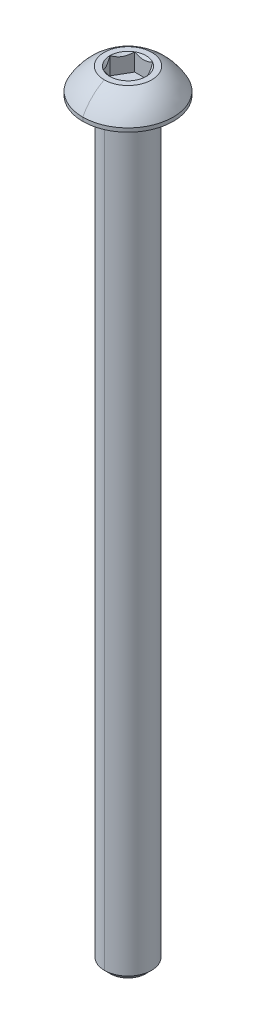
ISO-10303-21;
HEADER;
FILE_DESCRIPTION(('STEP AP214'),'2;1');
FILE_NAME('part.step','',(''),(''),'','','');
FILE_SCHEMA(('AUTOMOTIVE_DESIGN { 1 0 10303 214 1 1 1 1 }'));
ENDSEC;
DATA;
#1=APPLICATION_CONTEXT('core data for automotive mechanical design processes');
#2=APPLICATION_PROTOCOL_DEFINITION('international standard','automotive_design',2000,#1);
#3=PRODUCT_CONTEXT('',#1,'mechanical');
#4=PRODUCT('Part','Part','',(#3));
#5=PRODUCT_RELATED_PRODUCT_CATEGORY('part','',(#4));
#6=PRODUCT_DEFINITION_FORMATION('','',#4);
#7=PRODUCT_DEFINITION_CONTEXT('part definition',#1,'design');
#8=PRODUCT_DEFINITION('design','',#6,#7);
#9=PRODUCT_DEFINITION_SHAPE('','',#8);
#10=(LENGTH_UNIT() NAMED_UNIT(*) SI_UNIT(.MILLI.,.METRE.));
#11=(NAMED_UNIT(*) PLANE_ANGLE_UNIT() SI_UNIT($,.RADIAN.));
#12=(NAMED_UNIT(*) SI_UNIT($,.STERADIAN.) SOLID_ANGLE_UNIT());
#13=UNCERTAINTY_MEASURE_WITH_UNIT(LENGTH_MEASURE(1.E-05),#10,'distance_accuracy_value','');
#14=(GEOMETRIC_REPRESENTATION_CONTEXT(3) GLOBAL_UNCERTAINTY_ASSIGNED_CONTEXT((#13)) GLOBAL_UNIT_ASSIGNED_CONTEXT((#10,
#11,#12)) REPRESENTATION_CONTEXT('',''));
#15=CARTESIAN_POINT('',(0.,0.,0.));
#16=DIRECTION('',(0.,0.,1.));
#17=DIRECTION('',(1.,0.,0.));
#18=AXIS2_PLACEMENT_3D('',#15,#16,#17);
#19=CARTESIAN_POINT('',(0.,-0.152399999999997,0.));
#20=DIRECTION('',(0.,1.,0.));
#21=DIRECTION('',(0.,0.,1.));
#22=AXIS2_PLACEMENT_3D('',#19,#20,#21);
#23=TOROIDAL_SURFACE('',#22,2.5273,0.1524);
#24=CARTESIAN_POINT('',(0.,-0.152399999999997,-2.5273));
#25=DIRECTION('',(1.,0.,0.));
#26=DIRECTION('',(0.,0.,-1.));
#27=AXIS2_PLACEMENT_3D('',#24,#25,#26);
#28=CIRCLE('',#27,0.1524);
#29=CARTESIAN_POINT('',(0.,0.,-2.5273));
#30=VERTEX_POINT('',#29);
#31=CARTESIAN_POINT('',(0.,-0.152399999999997,-2.3749));
#32=VERTEX_POINT('',#31);
#33=EDGE_CURVE('E189',#30,#32,#28,.T.);
#34=ORIENTED_EDGE('',*,*,#33,.F.);
#35=CARTESIAN_POINT('',(0.,0.,0.));
#36=DIRECTION('',(0.,1.,0.));
#37=DIRECTION('',(0.,0.,1.));
#38=AXIS2_PLACEMENT_3D('',#35,#36,#37);
#39=CIRCLE('',#38,2.5273);
#40=CARTESIAN_POINT('',(0.,0.,2.5273));
#41=VERTEX_POINT('',#40);
#42=EDGE_CURVE('E215',#41,#30,#39,.T.);
#43=ORIENTED_EDGE('',*,*,#42,.F.);
#44=CARTESIAN_POINT('',(0.,-0.152399999999997,2.5273));
#45=DIRECTION('',(-1.,0.,0.));
#46=DIRECTION('',(0.,0.,1.));
#47=AXIS2_PLACEMENT_3D('',#44,#45,#46);
#48=CIRCLE('',#47,0.1524);
#49=CARTESIAN_POINT('',(0.,-0.152399999999997,2.3749));
#50=VERTEX_POINT('',#49);
#51=EDGE_CURVE('E206',#41,#50,#48,.T.);
#52=ORIENTED_EDGE('',*,*,#51,.T.);
#53=CARTESIAN_POINT('',(0.,-0.152399999999997,0.));
#54=DIRECTION('',(0.,-1.,0.));
#55=DIRECTION('',(0.,0.,1.));
#56=AXIS2_PLACEMENT_3D('',#53,#54,#55);
#57=CIRCLE('',#56,2.3749);
#58=EDGE_CURVE('E364',#32,#50,#57,.T.);
#59=ORIENTED_EDGE('',*,*,#58,.F.);
#60=EDGE_LOOP('',(#34,#43,#52,#59));
#61=FACE_BOUND('',#60,.T.);
#62=ADVANCED_FACE('F16',(#61),#23,.F.);
#63=CARTESIAN_POINT('',(0.,2.5654,0.));
#64=DIRECTION('',(0.,1.,0.));
#65=DIRECTION('',(0.,0.,1.));
#66=AXIS2_PLACEMENT_3D('',#63,#64,#65);
#67=CONICAL_SURFACE('',#66,1.83308710467706,0.78539816339745);
#68=DIRECTION('',(0.,0.707106781186546,-0.707106781186549));
#69=VECTOR('',#68,1.);
#70=CARTESIAN_POINT('',(0.,2.5654,-1.83308710467706));
#71=LINE('',#70,#69);
#72=CARTESIAN_POINT('',(0.,0.732312895322944,0.));
#73=VERTEX_POINT('',#72);
#74=CARTESIAN_POINT('',(0.,0.7874,-0.0550871046770556));
#75=VERTEX_POINT('',#74);
#76=EDGE_CURVE('E222',#73,#75,#71,.T.);
#77=ORIENTED_EDGE('',*,*,#76,.F.);
#78=DIRECTION('',(0.,0.707106781186546,0.707106781186549));
#79=VECTOR('',#78,1.);
#80=CARTESIAN_POINT('',(0.,2.5654,1.83308710467706));
#81=LINE('',#80,#79);
#82=CARTESIAN_POINT('',(0.,0.7874,0.0550871046770556));
#83=VERTEX_POINT('',#82);
#84=EDGE_CURVE('E218',#73,#83,#81,.T.);
#85=ORIENTED_EDGE('',*,*,#84,.T.);
#86=CARTESIAN_POINT('',(0.,0.7874,0.));
#87=DIRECTION('',(0.,1.,0.));
#88=DIRECTION('',(0.,0.,1.));
#89=AXIS2_PLACEMENT_3D('',#86,#87,#88);
#90=CIRCLE('',#89,0.0550871046770558);
#91=EDGE_CURVE('E165',#83,#75,#90,.T.);
#92=ORIENTED_EDGE('',*,*,#91,.T.);
#93=EDGE_LOOP('',(#77,#85,#92));
#94=FACE_BOUND('',#93,.T.);
#95=ADVANCED_FACE('F263',(#94),#67,.F.);
#96=CARTESIAN_POINT('',(1.83308710467706,0.7874,0.));
#97=DIRECTION('',(0.866025403784439,0.,-0.5));
#98=DIRECTION('',(0.,-1.,0.));
#99=AXIS2_PLACEMENT_3D('',#96,#97,#98);
#100=PLANE('',#99);
#101=DIRECTION('',(0.,1.,0.));
#102=VECTOR('',#101,1.);
#103=CARTESIAN_POINT('',(1.83308710467706,0.7874,0.));
#104=LINE('',#103,#102);
#105=CARTESIAN_POINT('',(1.83308710467706,0.7874,0.));
#106=VERTEX_POINT('',#105);
#107=CARTESIAN_POINT('',(1.83308710467706,2.5654,0.));
#108=VERTEX_POINT('',#107);
#109=EDGE_CURVE('E11',#106,#108,#104,.T.);
#110=ORIENTED_EDGE('',*,*,#109,.T.);
#111=CARTESIAN_POINT('',(1.83308710467706,2.5654,0.));
#112=CARTESIAN_POINT('',(1.58854939316106,2.32086228848399,-0.423551740712339));
#113=CARTESIAN_POINT('',(1.37650342717985,2.31981648546325,-0.790826127331817));
#114=CARTESIAN_POINT('',(1.16317917435944,2.31876437797812,-1.16031457170343));
#115=CARTESIAN_POINT('',(0.91654355233853,2.5654,-1.5875));
#116=B_SPLINE_CURVE_WITH_KNOTS('',2,(#111,#112,#113,#114,#115),.UNSPECIFIED.,.F.,.F.,(3,2,3),
(0.,0.5,1.),.UNSPECIFIED.);
#117=CARTESIAN_POINT('',(0.916543552338531,2.5654,-1.5875));
#118=VERTEX_POINT('',#117);
#119=EDGE_CURVE('E158',#108,#118,#116,.T.);
#120=ORIENTED_EDGE('',*,*,#119,.T.);
#121=DIRECTION('',(0.,1.,0.));
#122=VECTOR('',#121,1.);
#123=CARTESIAN_POINT('',(0.916543552338531,0.7874,-1.5875));
#124=LINE('',#123,#122);
#125=CARTESIAN_POINT('',(0.916543552338531,0.7874,-1.5875));
#126=VERTEX_POINT('',#125);
#127=EDGE_CURVE('E152',#126,#118,#124,.T.);
#128=ORIENTED_EDGE('',*,*,#127,.F.);
#129=DIRECTION('',(-0.5,0.,-0.866025403784439));
#130=VECTOR('',#129,1.);
#131=CARTESIAN_POINT('',(1.83308710467706,0.7874,0.));
#132=LINE('',#131,#130);
#133=EDGE_CURVE('E156',#106,#126,#132,.T.);
#134=ORIENTED_EDGE('',*,*,#133,.F.);
#135=EDGE_LOOP('',(#110,#120,#128,#134));
#136=FACE_BOUND('',#135,.T.);
#137=ADVANCED_FACE('F154',(#136),#100,.F.);
#138=CARTESIAN_POINT('',(0.916543552338531,0.7874,1.5875));
#139=DIRECTION('',(0.866025403784439,0.,0.5));
#140=DIRECTION('',(0.,-1.,0.));
#141=AXIS2_PLACEMENT_3D('',#138,#139,#140);
#142=PLANE('',#141);
#143=DIRECTION('',(0.,1.,0.));
#144=VECTOR('',#143,1.);
#145=CARTESIAN_POINT('',(0.916543552338531,0.7874,1.5875));
#146=LINE('',#145,#144);
#147=CARTESIAN_POINT('',(0.916543552338531,0.7874,1.5875));
#148=VERTEX_POINT('',#147);
#149=CARTESIAN_POINT('',(0.916543552338531,2.5654,1.5875));
#150=VERTEX_POINT('',#149);
#151=EDGE_CURVE('E29',#148,#150,#146,.T.);
#152=ORIENTED_EDGE('',*,*,#151,.T.);
#153=CARTESIAN_POINT('',(0.916543552338531,2.5654,1.5875));
#154=CARTESIAN_POINT('',(1.16108126385472,2.32086228848382,1.16394825928734));
#155=CARTESIAN_POINT('',(1.37312722983574,2.31981648546325,0.796673872668184));
#156=CARTESIAN_POINT('',(1.58645148265633,2.3187643779783,0.427185428296259));
#157=CARTESIAN_POINT('',(1.83308710467706,2.5654,0.));
#158=B_SPLINE_CURVE_WITH_KNOTS('',2,(#153,#154,#155,#156,#157),.UNSPECIFIED.,.F.,.F.,(3,2,3),
(0.,0.5,1.),.UNSPECIFIED.);
#159=EDGE_CURVE('E186',#150,#108,#158,.T.);
#160=ORIENTED_EDGE('',*,*,#159,.T.);
#161=ORIENTED_EDGE('',*,*,#109,.F.);
#162=DIRECTION('',(0.5,0.,-0.866025403784439));
#163=VECTOR('',#162,1.);
#164=CARTESIAN_POINT('',(0.916543552338531,0.7874,1.5875));
#165=LINE('',#164,#163);
#166=EDGE_CURVE('E179',#148,#106,#165,.T.);
#167=ORIENTED_EDGE('',*,*,#166,.F.);
#168=EDGE_LOOP('',(#152,#160,#161,#167));
#169=FACE_BOUND('',#168,.T.);
#170=ADVANCED_FACE('F262',(#169),#142,.F.);
#171=CARTESIAN_POINT('',(-0.91654355233853,0.7874,1.5875));
#172=DIRECTION('',(0.,0.,1.));
#173=DIRECTION('',(1.,0.,0.));
#174=AXIS2_PLACEMENT_3D('',#171,#172,#173);
#175=PLANE('',#174);
#176=DIRECTION('',(0.,1.,0.));
#177=VECTOR('',#176,1.);
#178=CARTESIAN_POINT('',(-0.91654355233853,0.7874,1.5875));
#179=LINE('',#178,#177);
#180=CARTESIAN_POINT('',(-0.91654355233853,0.7874,1.5875));
#181=VERTEX_POINT('',#180);
#182=CARTESIAN_POINT('',(-0.91654355233853,2.5654,1.5875));
#183=VERTEX_POINT('',#182);
#184=EDGE_CURVE('E306',#181,#183,#179,.T.);
#185=ORIENTED_EDGE('',*,*,#184,.T.);
#186=CARTESIAN_POINT('',(-0.916543552338531,2.5654,1.5875));
#187=CARTESIAN_POINT('',(-0.684381010738564,2.44931872920002,1.5875));
#188=CARTESIAN_POINT('',(-0.4718738638875,2.38845938444161,1.5875));
#189=CARTESIAN_POINT('',(-0.232175759974894,2.31981289532294,1.5875));
#190=CARTESIAN_POINT('',(0.,2.31981289532294,1.5875));
#191=B_SPLINE_CURVE_WITH_KNOTS('',2,(#186,#187,#188,#189,#190),.UNSPECIFIED.,.F.,.F.,(3,2,3),
(0.,0.5,1.),.UNSPECIFIED.);
#192=CARTESIAN_POINT('',(0.,2.31981289532294,1.5875));
#193=VERTEX_POINT('',#192);
#194=EDGE_CURVE('E505',#183,#193,#191,.T.);
#195=ORIENTED_EDGE('',*,*,#194,.T.);
#196=CARTESIAN_POINT('',(0.,2.31981289532294,1.5875));
#197=CARTESIAN_POINT('',(0.229732695645398,2.31981289532294,1.5875));
#198=CARTESIAN_POINT('',(0.471961624215038,2.3884843914945,1.5875));
#199=CARTESIAN_POINT('',(0.68154594324368,2.44790119545257,1.5875));
#200=CARTESIAN_POINT('',(0.91654355233853,2.5654,1.5875));
#201=B_SPLINE_CURVE_WITH_KNOTS('',2,(#196,#197,#198,#199,#200),.UNSPECIFIED.,.F.,.F.,(3,2,3),
(0.,0.5,1.),.UNSPECIFIED.);
#202=EDGE_CURVE('E436',#193,#150,#201,.T.);
#203=ORIENTED_EDGE('',*,*,#202,.T.);
#204=ORIENTED_EDGE('',*,*,#151,.F.);
#205=DIRECTION('',(1.,0.,0.));
#206=VECTOR('',#205,1.);
#207=CARTESIAN_POINT('',(-0.91654355233853,0.7874,1.5875));
#208=LINE('',#207,#206);
#209=EDGE_CURVE('E207',#181,#148,#208,.T.);
#210=ORIENTED_EDGE('',*,*,#209,.F.);
#211=EDGE_LOOP('',(#185,#195,#203,#204,#210));
#212=FACE_BOUND('',#211,.T.);
#213=ADVANCED_FACE('F476',(#212),#175,.F.);
#214=CARTESIAN_POINT('',(-1.83308710467706,0.7874,0.));
#215=DIRECTION('',(-0.866025403784439,0.,0.5));
#216=DIRECTION('',(0.,1.,0.));
#217=AXIS2_PLACEMENT_3D('',#214,#215,#216);
#218=PLANE('',#217);
#219=DIRECTION('',(0.,1.,0.));
#220=VECTOR('',#219,1.);
#221=CARTESIAN_POINT('',(-1.83308710467706,0.7874,0.));
#222=LINE('',#221,#220);
#223=CARTESIAN_POINT('',(-1.83308710467706,0.7874,0.));
#224=VERTEX_POINT('',#223);
#225=CARTESIAN_POINT('',(-1.83308710467706,2.5654,0.));
#226=VERTEX_POINT('',#225);
#227=EDGE_CURVE('E297',#224,#226,#222,.T.);
#228=ORIENTED_EDGE('',*,*,#227,.T.);
#229=CARTESIAN_POINT('',(-1.83308710467706,2.5654,0.));
#230=CARTESIAN_POINT('',(-1.58854939316106,2.32086228848399,0.423551740712331));
#231=CARTESIAN_POINT('',(-1.37650342717985,2.31981648546325,0.790826127331817));
#232=CARTESIAN_POINT('',(-1.16317917435944,2.31876437797812,1.16031457170343));
#233=CARTESIAN_POINT('',(-0.91654355233853,2.5654,1.5875));
#234=B_SPLINE_CURVE_WITH_KNOTS('',2,(#229,#230,#231,#232,#233),.UNSPECIFIED.,.F.,.F.,(3,2,3),
(0.,0.5,1.),.UNSPECIFIED.);
#235=EDGE_CURVE('E463',#226,#183,#234,.T.);
#236=ORIENTED_EDGE('',*,*,#235,.T.);
#237=ORIENTED_EDGE('',*,*,#184,.F.);
#238=DIRECTION('',(0.5,0.,0.866025403784438));
#239=VECTOR('',#238,1.);
#240=CARTESIAN_POINT('',(-1.83308710467706,0.7874,0.));
#241=LINE('',#240,#239);
#242=EDGE_CURVE('E210',#224,#181,#241,.T.);
#243=ORIENTED_EDGE('',*,*,#242,.F.);
#244=EDGE_LOOP('',(#228,#236,#237,#243));
#245=FACE_BOUND('',#244,.T.);
#246=ADVANCED_FACE('F335',(#245),#218,.F.);
#247=CARTESIAN_POINT('',(-0.916543552338531,0.7874,-1.5875));
#248=DIRECTION('',(-0.866025403784439,0.,-0.5));
#249=DIRECTION('',(-0.5,0.,0.866025403784439));
#250=AXIS2_PLACEMENT_3D('',#247,#248,#249);
#251=PLANE('',#250);
#252=DIRECTION('',(0.,1.,0.));
#253=VECTOR('',#252,1.);
#254=CARTESIAN_POINT('',(-0.916543552338531,0.7874,-1.5875));
#255=LINE('',#254,#253);
#256=CARTESIAN_POINT('',(-0.916543552338531,0.7874,-1.5875));
#257=VERTEX_POINT('',#256);
#258=CARTESIAN_POINT('',(-0.916543552338531,2.5654,-1.5875));
#259=VERTEX_POINT('',#258);
#260=EDGE_CURVE('E164',#257,#259,#255,.T.);
#261=ORIENTED_EDGE('',*,*,#260,.T.);
#262=CARTESIAN_POINT('',(-0.916543552338531,2.5654,-1.5875));
#263=CARTESIAN_POINT('',(-1.16108126385453,2.320862288484,-1.16394825928767));
#264=CARTESIAN_POINT('',(-1.37312722983574,2.31981648546325,-0.796673872668183));
#265=CARTESIAN_POINT('',(-1.58645148265615,2.31876437797813,-0.427185428296571));
#266=CARTESIAN_POINT('',(-1.83308710467706,2.5654,0.));
#267=B_SPLINE_CURVE_WITH_KNOTS('',2,(#262,#263,#264,#265,#266),.UNSPECIFIED.,.F.,.F.,(3,2,3),
(0.,0.5,1.),.UNSPECIFIED.);
#268=EDGE_CURVE('E321',#259,#226,#267,.T.);
#269=ORIENTED_EDGE('',*,*,#268,.T.);
#270=ORIENTED_EDGE('',*,*,#227,.F.);
#271=DIRECTION('',(-0.5,0.,0.866025403784439));
#272=VECTOR('',#271,1.);
#273=CARTESIAN_POINT('',(-0.916543552338531,0.7874,-1.5875));
#274=LINE('',#273,#272);
#275=EDGE_CURVE('E174',#257,#224,#274,.T.);
#276=ORIENTED_EDGE('',*,*,#275,.F.);
#277=EDGE_LOOP('',(#261,#269,#270,#276));
#278=FACE_BOUND('',#277,.T.);
#279=ADVANCED_FACE('F326',(#278),#251,.F.);
#280=CARTESIAN_POINT('',(0.916543552338531,0.7874,-1.5875));
#281=DIRECTION('',(0.,0.,-1.));
#282=DIRECTION('',(-1.,0.,0.));
#283=AXIS2_PLACEMENT_3D('',#280,#281,#282);
#284=PLANE('',#283);
#285=ORIENTED_EDGE('',*,*,#127,.T.);
#286=CARTESIAN_POINT('',(0.916543552338531,2.5654,-1.5875));
#287=CARTESIAN_POINT('',(0.68330023814449,2.44877834290298,-1.5875));
#288=CARTESIAN_POINT('',(0.472022049766507,2.38850161206546,-1.5875));
#289=CARTESIAN_POINT('',(0.231606862063275,2.31991222444484,-1.5875));
#290=CARTESIAN_POINT('',(0.000126990617285933,2.31981290040219,-1.5875));
#291=CARTESIAN_POINT('',(-0.230319895797069,2.3197140195957,-1.5875));
#292=CARTESIAN_POINT('',(-0.471813597713689,2.38844221424328,-1.5875));
#293=CARTESIAN_POINT('',(-0.682613944360854,2.44843519601116,-1.5875));
#294=CARTESIAN_POINT('',(-0.916543552338529,2.5654,-1.5875));
#295=B_SPLINE_CURVE_WITH_KNOTS('',2,(#286,#287,#288,#289,#290,#291,#292,#293,#294),
.UNSPECIFIED.,.F.,.F.,(3,2,2,2,3),(0.,0.25,0.5,0.75,1.),.UNSPECIFIED.);
#296=EDGE_CURVE('E313',#118,#259,#295,.T.);
#297=ORIENTED_EDGE('',*,*,#296,.T.);
#298=ORIENTED_EDGE('',*,*,#260,.F.);
#299=DIRECTION('',(-1.,0.,0.));
#300=VECTOR('',#299,1.);
#301=CARTESIAN_POINT('',(0.916543552338531,0.7874,-1.5875));
#302=LINE('',#301,#300);
#303=EDGE_CURVE('E168',#126,#257,#302,.T.);
#304=ORIENTED_EDGE('',*,*,#303,.F.);
#305=EDGE_LOOP('',(#285,#297,#298,#304));
#306=FACE_BOUND('',#305,.T.);
#307=ADVANCED_FACE('F169',(#306),#284,.F.);
#308=CARTESIAN_POINT('',(0.,0.7874,0.));
#309=DIRECTION('',(0.,1.,0.));
#310=DIRECTION('',(1.,0.,0.));
#311=AXIS2_PLACEMENT_3D('',#308,#309,#310);
#312=PLANE('',#311);
#313=ORIENTED_EDGE('',*,*,#91,.F.);
#314=CARTESIAN_POINT('',(0.,0.7874,0.));
#315=DIRECTION('',(0.,1.,0.));
#316=DIRECTION('',(0.,0.,1.));
#317=AXIS2_PLACEMENT_3D('',#314,#315,#316);
#318=CIRCLE('',#317,0.0550871046770558);
#319=EDGE_CURVE('E377',#75,#83,#318,.T.);
#320=ORIENTED_EDGE('',*,*,#319,.F.);
#321=EDGE_LOOP('',(#313,#320));
#322=FACE_BOUND('',#321,.T.);
#323=ORIENTED_EDGE('',*,*,#133,.T.);
#324=ORIENTED_EDGE('',*,*,#303,.T.);
#325=ORIENTED_EDGE('',*,*,#275,.T.);
#326=ORIENTED_EDGE('',*,*,#242,.T.);
#327=ORIENTED_EDGE('',*,*,#209,.T.);
#328=ORIENTED_EDGE('',*,*,#166,.T.);
#329=EDGE_LOOP('',(#323,#324,#325,#326,#327,#328));
#330=FACE_BOUND('',#329,.T.);
#331=ADVANCED_FACE('F177',(#322,#330),#312,.T.);
#332=CARTESIAN_POINT('',(0.,2.5654,0.));
#333=DIRECTION('',(0.,1.,0.));
#334=DIRECTION('',(0.,0.,1.));
#335=AXIS2_PLACEMENT_3D('',#332,#333,#334);
#336=CONICAL_SURFACE('',#335,1.83308710467706,0.78539816339745);
#337=CARTESIAN_POINT('',(0.,2.5654,0.));
#338=DIRECTION('',(0.,1.,0.));
#339=DIRECTION('',(0.,0.,1.));
#340=AXIS2_PLACEMENT_3D('',#337,#338,#339);
#341=CIRCLE('',#340,1.83308710467706);
#342=EDGE_CURVE('E547',#108,#118,#341,.T.);
#343=ORIENTED_EDGE('',*,*,#342,.T.);
#344=ORIENTED_EDGE('',*,*,#119,.F.);
#345=EDGE_LOOP('',(#343,#344));
#346=FACE_BOUND('',#345,.T.);
#347=ADVANCED_FACE('F481',(#346),#336,.F.);
#348=CARTESIAN_POINT('',(0.,2.5654,0.));
#349=DIRECTION('',(0.,1.,0.));
#350=DIRECTION('',(0.,0.,1.));
#351=AXIS2_PLACEMENT_3D('',#348,#349,#350);
#352=CONICAL_SURFACE('',#351,1.83308710467706,0.78539816339745);
#353=CARTESIAN_POINT('',(0.,2.5654,0.));
#354=DIRECTION('',(0.,1.,0.));
#355=DIRECTION('',(0.,0.,1.));
#356=AXIS2_PLACEMENT_3D('',#353,#354,#355);
#357=CIRCLE('',#356,1.83308710467706);
#358=EDGE_CURVE('E545',#150,#108,#357,.T.);
#359=ORIENTED_EDGE('',*,*,#358,.T.);
#360=ORIENTED_EDGE('',*,*,#159,.F.);
#361=EDGE_LOOP('',(#359,#360));
#362=FACE_BOUND('',#361,.T.);
#363=ADVANCED_FACE('F478',(#362),#352,.F.);
#364=CARTESIAN_POINT('',(0.,2.5654,0.));
#365=DIRECTION('',(0.,1.,0.));
#366=DIRECTION('',(0.,0.,1.));
#367=AXIS2_PLACEMENT_3D('',#364,#365,#366);
#368=CONICAL_SURFACE('',#367,1.83308710467706,0.78539816339745);
#369=DIRECTION('',(0.,0.707106781186546,0.707106781186549));
#370=VECTOR('',#369,1.);
#371=CARTESIAN_POINT('',(0.,2.5654,1.83308710467706));
#372=LINE('',#371,#370);
#373=CARTESIAN_POINT('',(0.,2.5654,1.83308710467706));
#374=VERTEX_POINT('',#373);
#375=EDGE_CURVE('E440',#193,#374,#372,.T.);
#376=ORIENTED_EDGE('',*,*,#375,.F.);
#377=ORIENTED_EDGE('',*,*,#194,.F.);
#378=CARTESIAN_POINT('',(0.,2.5654,0.));
#379=DIRECTION('',(0.,1.,0.));
#380=DIRECTION('',(0.,0.,1.));
#381=AXIS2_PLACEMENT_3D('',#378,#379,#380);
#382=CIRCLE('',#381,1.83308710467706);
#383=EDGE_CURVE('E542',#183,#374,#382,.T.);
#384=ORIENTED_EDGE('',*,*,#383,.T.);
#385=EDGE_LOOP('',(#376,#377,#384));
#386=FACE_BOUND('',#385,.T.);
#387=ADVANCED_FACE('F288',(#386),#368,.F.);
#388=CARTESIAN_POINT('',(0.,2.5654,0.));
#389=DIRECTION('',(0.,1.,0.));
#390=DIRECTION('',(0.,0.,1.));
#391=AXIS2_PLACEMENT_3D('',#388,#389,#390);
#392=CONICAL_SURFACE('',#391,1.83308710467706,0.78539816339745);
#393=CARTESIAN_POINT('',(0.,2.5654,0.));
#394=DIRECTION('',(0.,1.,0.));
#395=DIRECTION('',(0.,0.,1.));
#396=AXIS2_PLACEMENT_3D('',#393,#394,#395);
#397=CIRCLE('',#396,1.83308710467706);
#398=EDGE_CURVE('E314',#226,#183,#397,.T.);
#399=ORIENTED_EDGE('',*,*,#398,.T.);
#400=ORIENTED_EDGE('',*,*,#235,.F.);
#401=EDGE_LOOP('',(#399,#400));
#402=FACE_BOUND('',#401,.T.);
#403=ADVANCED_FACE('F283',(#402),#392,.F.);
#404=CARTESIAN_POINT('',(0.,2.5654,0.));
#405=DIRECTION('',(0.,1.,0.));
#406=DIRECTION('',(0.,0.,1.));
#407=AXIS2_PLACEMENT_3D('',#404,#405,#406);
#408=CONICAL_SURFACE('',#407,1.83308710467706,0.78539816339745);
#409=CARTESIAN_POINT('',(0.,2.5654,0.));
#410=DIRECTION('',(0.,1.,0.));
#411=DIRECTION('',(0.,0.,1.));
#412=AXIS2_PLACEMENT_3D('',#409,#410,#411);
#413=CIRCLE('',#412,1.83308710467706);
#414=EDGE_CURVE('E309',#259,#226,#413,.T.);
#415=ORIENTED_EDGE('',*,*,#414,.T.);
#416=ORIENTED_EDGE('',*,*,#268,.F.);
#417=EDGE_LOOP('',(#415,#416));
#418=FACE_BOUND('',#417,.T.);
#419=ADVANCED_FACE('F287',(#418),#408,.F.);
#420=CARTESIAN_POINT('',(0.,2.5654,0.));
#421=DIRECTION('',(0.,1.,0.));
#422=DIRECTION('',(0.,0.,1.));
#423=AXIS2_PLACEMENT_3D('',#420,#421,#422);
#424=CONICAL_SURFACE('',#423,1.83308710467706,0.78539816339745);
#425=CARTESIAN_POINT('',(0.,2.5654,0.));
#426=DIRECTION('',(0.,1.,0.));
#427=DIRECTION('',(0.,0.,1.));
#428=AXIS2_PLACEMENT_3D('',#425,#426,#427);
#429=CIRCLE('',#428,1.83308710467706);
#430=EDGE_CURVE('E246',#118,#259,#429,.T.);
#431=ORIENTED_EDGE('',*,*,#430,.T.);
#432=ORIENTED_EDGE('',*,*,#296,.F.);
#433=EDGE_LOOP('',(#431,#432));
#434=FACE_BOUND('',#433,.T.);
#435=ADVANCED_FACE('F600',(#434),#424,.F.);
#436=CARTESIAN_POINT('',(0.,2.5654,-2.413));
#437=DIRECTION('',(0.,-1.,0.));
#438=DIRECTION('',(0.,0.,-1.));
#439=AXIS2_PLACEMENT_3D('',#436,#437,#438);
#440=PLANE('',#439);
#441=ORIENTED_EDGE('',*,*,#430,.F.);
#442=ORIENTED_EDGE('',*,*,#342,.F.);
#443=ORIENTED_EDGE('',*,*,#358,.F.);
#444=CARTESIAN_POINT('',(0.,2.5654,0.));
#445=DIRECTION('',(0.,1.,0.));
#446=DIRECTION('',(0.,0.,1.));
#447=AXIS2_PLACEMENT_3D('',#444,#445,#446);
#448=CIRCLE('',#447,1.83308710467706);
#449=EDGE_CURVE('E426',#374,#150,#448,.T.);
#450=ORIENTED_EDGE('',*,*,#449,.F.);
#451=ORIENTED_EDGE('',*,*,#383,.F.);
#452=ORIENTED_EDGE('',*,*,#398,.F.);
#453=ORIENTED_EDGE('',*,*,#414,.F.);
#454=EDGE_LOOP('',(#441,#442,#443,#450,#451,#452,#453));
#455=FACE_BOUND('',#454,.T.);
#456=CARTESIAN_POINT('',(0.,2.5654,0.));
#457=DIRECTION('',(0.,1.,0.));
#458=DIRECTION('',(0.,0.,1.));
#459=AXIS2_PLACEMENT_3D('',#456,#457,#458);
#460=CIRCLE('',#459,2.413);
#461=CARTESIAN_POINT('',(0.,2.5654,2.413));
#462=VERTEX_POINT('',#461);
#463=CARTESIAN_POINT('',(0.,2.5654,-2.413));
#464=VERTEX_POINT('',#463);
#465=EDGE_CURVE('E196',#462,#464,#460,.T.);
#466=ORIENTED_EDGE('',*,*,#465,.T.);
#467=CARTESIAN_POINT('',(0.,2.5654,0.));
#468=DIRECTION('',(0.,1.,0.));
#469=DIRECTION('',(0.,0.,1.));
#470=AXIS2_PLACEMENT_3D('',#467,#468,#469);
#471=CIRCLE('',#470,2.413);
#472=EDGE_CURVE('E214',#464,#462,#471,.T.);
#473=ORIENTED_EDGE('',*,*,#472,.T.);
#474=EDGE_LOOP('',(#466,#473));
#475=FACE_BOUND('',#474,.T.);
#476=ADVANCED_FACE('F539',(#455,#475),#440,.F.);
#477=CARTESIAN_POINT('',(0.,-1.9398474797777,0.));
#478=DIRECTION('',(0.,1.,0.));
#479=DIRECTION('',(0.,0.,1.));
#480=AXIS2_PLACEMENT_3D('',#477,#478,#479);
#481=DEGENERATE_TOROIDAL_SURFACE('',#480,0.065843178235288,5.08,.T.);
#482=CARTESIAN_POINT('',(0.,-1.9398474797777,-0.065843178235288));
#483=DIRECTION('',(1.,0.,0.));
#484=DIRECTION('',(0.,0.,-1.));
#485=AXIS2_PLACEMENT_3D('',#482,#483,#484);
#486=CIRCLE('',#485,5.08);
#487=CARTESIAN_POINT('',(0.,0.381,-4.5847));
#488=VERTEX_POINT('',#487);
#489=EDGE_CURVE('E201',#488,#464,#486,.T.);
#490=ORIENTED_EDGE('',*,*,#489,.F.);
#491=CARTESIAN_POINT('',(0.,0.381,0.));
#492=DIRECTION('',(0.,1.,0.));
#493=DIRECTION('',(0.,0.,1.));
#494=AXIS2_PLACEMENT_3D('',#491,#492,#493);
#495=CIRCLE('',#494,4.5847);
#496=CARTESIAN_POINT('',(0.,0.381,4.5847));
#497=VERTEX_POINT('',#496);
#498=EDGE_CURVE('E211',#488,#497,#495,.T.);
#499=ORIENTED_EDGE('',*,*,#498,.T.);
#500=CARTESIAN_POINT('',(0.,-1.9398474797777,0.065843178235288));
#501=DIRECTION('',(-1.,0.,0.));
#502=DIRECTION('',(0.,0.,1.));
#503=AXIS2_PLACEMENT_3D('',#500,#501,#502);
#504=CIRCLE('',#503,5.08);
#505=EDGE_CURVE('E200',#497,#462,#504,.T.);
#506=ORIENTED_EDGE('',*,*,#505,.T.);
#507=ORIENTED_EDGE('',*,*,#472,.F.);
#508=EDGE_LOOP('',(#490,#499,#506,#507));
#509=FACE_BOUND('',#508,.T.);
#510=ADVANCED_FACE('F520',(#509),#481,.T.);
#511=CARTESIAN_POINT('',(0.,2.5654,0.));
#512=DIRECTION('',(0.,1.,0.));
#513=DIRECTION('',(0.,0.,1.));
#514=AXIS2_PLACEMENT_3D('',#511,#512,#513);
#515=CYLINDRICAL_SURFACE('',#514,4.5847);
#516=DIRECTION('',(0.,1.,0.));
#517=VECTOR('',#516,1.);
#518=CARTESIAN_POINT('',(0.,2.5654,-4.5847));
#519=LINE('',#518,#517);
#520=CARTESIAN_POINT('',(0.,0.,-4.5847));
#521=VERTEX_POINT('',#520);
#522=EDGE_CURVE('E223',#521,#488,#519,.T.);
#523=ORIENTED_EDGE('',*,*,#522,.F.);
#524=CARTESIAN_POINT('',(0.,0.,0.));
#525=DIRECTION('',(0.,1.,0.));
#526=DIRECTION('',(0.,0.,1.));
#527=AXIS2_PLACEMENT_3D('',#524,#525,#526);
#528=CIRCLE('',#527,4.5847);
#529=CARTESIAN_POINT('',(0.,0.,4.5847));
#530=VERTEX_POINT('',#529);
#531=EDGE_CURVE('E194',#521,#530,#528,.T.);
#532=ORIENTED_EDGE('',*,*,#531,.T.);
#533=DIRECTION('',(0.,1.,0.));
#534=VECTOR('',#533,1.);
#535=CARTESIAN_POINT('',(0.,2.5654,4.5847));
#536=LINE('',#535,#534);
#537=EDGE_CURVE('E227',#530,#497,#536,.T.);
#538=ORIENTED_EDGE('',*,*,#537,.T.);
#539=ORIENTED_EDGE('',*,*,#498,.F.);
#540=EDGE_LOOP('',(#523,#532,#538,#539));
#541=FACE_BOUND('',#540,.T.);
#542=ADVANCED_FACE('F640',(#541),#515,.T.);
#543=CARTESIAN_POINT('',(0.,0.,0.));
#544=DIRECTION('',(0.,1.,0.));
#545=DIRECTION('',(1.,0.,0.));
#546=AXIS2_PLACEMENT_3D('',#543,#544,#545);
#547=PLANE('',#546);
#548=ORIENTED_EDGE('',*,*,#42,.T.);
#549=CARTESIAN_POINT('',(0.,0.,0.));
#550=DIRECTION('',(0.,1.,0.));
#551=DIRECTION('',(0.,0.,1.));
#552=AXIS2_PLACEMENT_3D('',#549,#550,#551);
#553=CIRCLE('',#552,2.5273);
#554=EDGE_CURVE('E369',#30,#41,#553,.T.);
#555=ORIENTED_EDGE('',*,*,#554,.T.);
#556=EDGE_LOOP('',(#548,#555));
#557=FACE_BOUND('',#556,.T.);
#558=CARTESIAN_POINT('',(0.,0.,0.));
#559=DIRECTION('',(0.,1.,0.));
#560=DIRECTION('',(0.,0.,1.));
#561=AXIS2_PLACEMENT_3D('',#558,#559,#560);
#562=CIRCLE('',#561,4.5847);
#563=EDGE_CURVE('E228',#530,#521,#562,.T.);
#564=ORIENTED_EDGE('',*,*,#563,.F.);
#565=ORIENTED_EDGE('',*,*,#531,.F.);
#566=EDGE_LOOP('',(#564,#565));
#567=FACE_BOUND('',#566,.T.);
#568=ADVANCED_FACE('F18',(#557,#567),#547,.F.);
#569=CARTESIAN_POINT('',(0.,-75.6158,0.));
#570=DIRECTION('',(0.,1.,0.));
#571=DIRECTION('',(0.,0.,1.));
#572=AXIS2_PLACEMENT_3D('',#569,#570,#571);
#573=CONICAL_SURFACE('',#572,2.3749,0.785398163397443);
#574=DIRECTION('',(0.,0.707106781186551,-0.707106781186545));
#575=VECTOR('',#574,1.);
#576=CARTESIAN_POINT('',(0.,-75.6158,-2.3749));
#577=LINE('',#576,#575);
#578=CARTESIAN_POINT('',(0.,-76.2,-1.79069999999997));
#579=VERTEX_POINT('',#578);
#580=CARTESIAN_POINT('',(0.,-75.6158,-2.3749));
#581=VERTEX_POINT('',#580);
#582=EDGE_CURVE('E234',#579,#581,#577,.T.);
#583=ORIENTED_EDGE('',*,*,#582,.F.);
#584=CARTESIAN_POINT('',(0.,-76.2,0.));
#585=DIRECTION('',(0.,-1.,0.));
#586=DIRECTION('',(0.,0.,1.));
#587=AXIS2_PLACEMENT_3D('',#584,#585,#586);
#588=CIRCLE('',#587,1.79069999999997);
#589=CARTESIAN_POINT('',(0.,-76.2,1.79069999999997));
#590=VERTEX_POINT('',#589);
#591=EDGE_CURVE('E191',#590,#579,#588,.T.);
#592=ORIENTED_EDGE('',*,*,#591,.F.);
#593=DIRECTION('',(0.,0.707106781186551,0.707106781186545));
#594=VECTOR('',#593,1.);
#595=CARTESIAN_POINT('',(0.,-75.6158,2.3749));
#596=LINE('',#595,#594);
#597=CARTESIAN_POINT('',(0.,-75.6158,2.3749));
#598=VERTEX_POINT('',#597);
#599=EDGE_CURVE('E233',#590,#598,#596,.T.);
#600=ORIENTED_EDGE('',*,*,#599,.T.);
#601=CARTESIAN_POINT('',(0.,-75.6158,0.));
#602=DIRECTION('',(0.,1.,0.));
#603=DIRECTION('',(0.,0.,1.));
#604=AXIS2_PLACEMENT_3D('',#601,#602,#603);
#605=CIRCLE('',#604,2.3749);
#606=EDGE_CURVE('E195',#581,#598,#605,.T.);
#607=ORIENTED_EDGE('',*,*,#606,.F.);
#608=EDGE_LOOP('',(#583,#592,#600,#607));
#609=FACE_BOUND('',#608,.T.);
#610=ADVANCED_FACE('F278',(#609),#573,.T.);
#611=CARTESIAN_POINT('',(0.,-76.2,0.));
#612=DIRECTION('',(0.,1.,0.));
#613=DIRECTION('',(1.,0.,0.));
#614=AXIS2_PLACEMENT_3D('',#611,#612,#613);
#615=PLANE('',#614);
#616=ORIENTED_EDGE('',*,*,#591,.T.);
#617=CARTESIAN_POINT('',(0.,-76.2,0.));
#618=DIRECTION('',(0.,-1.,0.));
#619=DIRECTION('',(0.,0.,1.));
#620=AXIS2_PLACEMENT_3D('',#617,#618,#619);
#621=CIRCLE('',#620,1.79069999999997);
#622=EDGE_CURVE('E381',#579,#590,#621,.T.);
#623=ORIENTED_EDGE('',*,*,#622,.T.);
#624=EDGE_LOOP('',(#616,#623));
#625=FACE_BOUND('',#624,.T.);
#626=ADVANCED_FACE('F281',(#625),#615,.F.);
#627=CARTESIAN_POINT('',(0.,-76.2,0.));
#628=DIRECTION('',(0.,1.,0.));
#629=DIRECTION('',(0.,0.,1.));
#630=AXIS2_PLACEMENT_3D('',#627,#628,#629);
#631=CYLINDRICAL_SURFACE('',#630,2.3749);
#632=DIRECTION('',(0.,1.,0.));
#633=VECTOR('',#632,1.);
#634=CARTESIAN_POINT('',(0.,-76.2,-2.3749));
#635=LINE('',#634,#633);
#636=EDGE_CURVE('E404',#581,#32,#635,.T.);
#637=ORIENTED_EDGE('',*,*,#636,.F.);
#638=ORIENTED_EDGE('',*,*,#606,.T.);
#639=DIRECTION('',(0.,1.,0.));
#640=VECTOR('',#639,1.);
#641=CARTESIAN_POINT('',(0.,-76.2,2.3749));
#642=LINE('',#641,#640);
#643=EDGE_CURVE('E241',#598,#50,#642,.T.);
#644=ORIENTED_EDGE('',*,*,#643,.T.);
#645=CARTESIAN_POINT('',(0.,-0.152399999999997,0.));
#646=DIRECTION('',(0.,-1.,0.));
#647=DIRECTION('',(0.,0.,1.));
#648=AXIS2_PLACEMENT_3D('',#645,#646,#647);
#649=CIRCLE('',#648,2.3749);
#650=EDGE_CURVE('E202',#50,#32,#649,.T.);
#651=ORIENTED_EDGE('',*,*,#650,.T.);
#652=EDGE_LOOP('',(#637,#638,#644,#651));
#653=FACE_BOUND('',#652,.T.);
#654=ADVANCED_FACE('F338',(#653),#631,.T.);
#655=CARTESIAN_POINT('',(0.,-76.2,0.));
#656=DIRECTION('',(0.,1.,0.));
#657=DIRECTION('',(0.,0.,1.));
#658=AXIS2_PLACEMENT_3D('',#655,#656,#657);
#659=CYLINDRICAL_SURFACE('',#658,2.3749);
#660=CARTESIAN_POINT('',(0.,-75.6158,0.));
#661=DIRECTION('',(0.,1.,0.));
#662=DIRECTION('',(0.,0.,1.));
#663=AXIS2_PLACEMENT_3D('',#660,#661,#662);
#664=CIRCLE('',#663,2.3749);
#665=EDGE_CURVE('E229',#598,#581,#664,.T.);
#666=ORIENTED_EDGE('',*,*,#665,.T.);
#667=ORIENTED_EDGE('',*,*,#636,.T.);
#668=ORIENTED_EDGE('',*,*,#58,.T.);
#669=ORIENTED_EDGE('',*,*,#643,.F.);
#670=EDGE_LOOP('',(#666,#667,#668,#669));
#671=FACE_BOUND('',#670,.T.);
#672=ADVANCED_FACE('F270',(#671),#659,.T.);
#673=CARTESIAN_POINT('',(0.,-75.6158,0.));
#674=DIRECTION('',(0.,1.,0.));
#675=DIRECTION('',(0.,0.,1.));
#676=AXIS2_PLACEMENT_3D('',#673,#674,#675);
#677=CONICAL_SURFACE('',#676,2.3749,0.785398163397443);
#678=ORIENTED_EDGE('',*,*,#622,.F.);
#679=ORIENTED_EDGE('',*,*,#582,.T.);
#680=ORIENTED_EDGE('',*,*,#665,.F.);
#681=ORIENTED_EDGE('',*,*,#599,.F.);
#682=EDGE_LOOP('',(#678,#679,#680,#681));
#683=FACE_BOUND('',#682,.T.);
#684=ADVANCED_FACE('F266',(#683),#677,.T.);
#685=CARTESIAN_POINT('',(0.,2.5654,0.));
#686=DIRECTION('',(0.,1.,0.));
#687=DIRECTION('',(0.,0.,1.));
#688=AXIS2_PLACEMENT_3D('',#685,#686,#687);
#689=CYLINDRICAL_SURFACE('',#688,4.5847);
#690=ORIENTED_EDGE('',*,*,#563,.T.);
#691=ORIENTED_EDGE('',*,*,#522,.T.);
#692=CARTESIAN_POINT('',(0.,0.381,0.));
#693=DIRECTION('',(0.,1.,0.));
#694=DIRECTION('',(0.,0.,1.));
#695=AXIS2_PLACEMENT_3D('',#692,#693,#694);
#696=CIRCLE('',#695,4.5847);
#697=EDGE_CURVE('E417',#497,#488,#696,.T.);
#698=ORIENTED_EDGE('',*,*,#697,.F.);
#699=ORIENTED_EDGE('',*,*,#537,.F.);
#700=EDGE_LOOP('',(#690,#691,#698,#699));
#701=FACE_BOUND('',#700,.T.);
#702=ADVANCED_FACE('F269',(#701),#689,.T.);
#703=CARTESIAN_POINT('',(0.,-1.9398474797777,0.));
#704=DIRECTION('',(0.,1.,0.));
#705=DIRECTION('',(0.,0.,1.));
#706=AXIS2_PLACEMENT_3D('',#703,#704,#705);
#707=DEGENERATE_TOROIDAL_SURFACE('',#706,0.065843178235288,5.08,.T.);
#708=ORIENTED_EDGE('',*,*,#697,.T.);
#709=ORIENTED_EDGE('',*,*,#489,.T.);
#710=ORIENTED_EDGE('',*,*,#465,.F.);
#711=ORIENTED_EDGE('',*,*,#505,.F.);
#712=EDGE_LOOP('',(#708,#709,#710,#711));
#713=FACE_BOUND('',#712,.T.);
#714=ADVANCED_FACE('F341',(#713),#707,.T.);
#715=CARTESIAN_POINT('',(0.,2.5654,0.));
#716=DIRECTION('',(0.,1.,0.));
#717=DIRECTION('',(0.,0.,1.));
#718=AXIS2_PLACEMENT_3D('',#715,#716,#717);
#719=CONICAL_SURFACE('',#718,1.83308710467706,0.78539816339745);
#720=ORIENTED_EDGE('',*,*,#202,.F.);
#721=ORIENTED_EDGE('',*,*,#375,.T.);
#722=ORIENTED_EDGE('',*,*,#449,.T.);
#723=EDGE_LOOP('',(#720,#721,#722));
#724=FACE_BOUND('',#723,.T.);
#725=ADVANCED_FACE('F276',(#724),#719,.F.);
#726=CARTESIAN_POINT('',(0.,2.5654,0.));
#727=DIRECTION('',(0.,1.,0.));
#728=DIRECTION('',(0.,0.,1.));
#729=AXIS2_PLACEMENT_3D('',#726,#727,#728);
#730=CONICAL_SURFACE('',#729,1.83308710467706,0.78539816339745);
#731=ORIENTED_EDGE('',*,*,#84,.F.);
#732=ORIENTED_EDGE('',*,*,#76,.T.);
#733=ORIENTED_EDGE('',*,*,#319,.T.);
#734=EDGE_LOOP('',(#731,#732,#733));
#735=FACE_BOUND('',#734,.T.);
#736=ADVANCED_FACE('F272',(#735),#730,.F.);
#737=CARTESIAN_POINT('',(0.,-0.152399999999997,0.));
#738=DIRECTION('',(0.,1.,0.));
#739=DIRECTION('',(0.,0.,1.));
#740=AXIS2_PLACEMENT_3D('',#737,#738,#739);
#741=TOROIDAL_SURFACE('',#740,2.5273,0.1524);
#742=ORIENTED_EDGE('',*,*,#554,.F.);
#743=ORIENTED_EDGE('',*,*,#33,.T.);
#744=ORIENTED_EDGE('',*,*,#650,.F.);
#745=ORIENTED_EDGE('',*,*,#51,.F.);
#746=EDGE_LOOP('',(#742,#743,#744,#745));
#747=FACE_BOUND('',#746,.T.);
#748=ADVANCED_FACE('F275',(#747),#741,.F.);
#749=CLOSED_SHELL('',(#62,#95,#137,#170,#213,#246,#279,#307,#331,#347,#363,#387,#403,#419,#435,
#476,#510,#542,#568,#610,#626,#654,#672,#684,#702,#714,#725,#736,#748));
#750=MANIFOLD_SOLID_BREP('B1',#749);
#751=ADVANCED_BREP_SHAPE_REPRESENTATION('',(#18,#750),#14);
#752=SHAPE_DEFINITION_REPRESENTATION(#9,#751);
ENDSEC;
END-ISO-10303-21;
